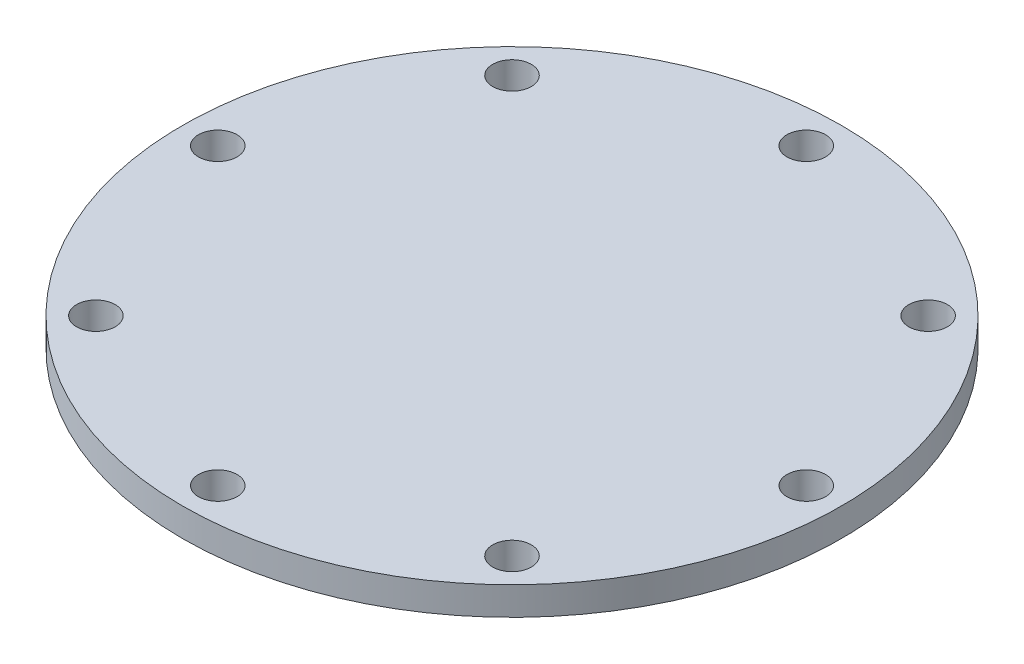
ISO-10303-21;
HEADER;
FILE_DESCRIPTION(('STEP AP214'),'2;1');
FILE_NAME('part.step','',(''),(''),'','','');
FILE_SCHEMA(('AUTOMOTIVE_DESIGN { 1 0 10303 214 1 1 1 1 }'));
ENDSEC;
DATA;
#1=APPLICATION_CONTEXT('core data for automotive mechanical design processes');
#2=APPLICATION_PROTOCOL_DEFINITION('international standard','automotive_design',2000,#1);
#3=PRODUCT_CONTEXT('',#1,'mechanical');
#4=PRODUCT('Part','Part','',(#3));
#5=PRODUCT_RELATED_PRODUCT_CATEGORY('part','',(#4));
#6=PRODUCT_DEFINITION_FORMATION('','',#4);
#7=PRODUCT_DEFINITION_CONTEXT('part definition',#1,'design');
#8=PRODUCT_DEFINITION('design','',#6,#7);
#9=PRODUCT_DEFINITION_SHAPE('','',#8);
#10=(LENGTH_UNIT() NAMED_UNIT(*) SI_UNIT(.MILLI.,.METRE.));
#11=(NAMED_UNIT(*) PLANE_ANGLE_UNIT() SI_UNIT($,.RADIAN.));
#12=(NAMED_UNIT(*) SI_UNIT($,.STERADIAN.) SOLID_ANGLE_UNIT());
#13=UNCERTAINTY_MEASURE_WITH_UNIT(LENGTH_MEASURE(1.E-05),#10,'distance_accuracy_value','');
#14=(GEOMETRIC_REPRESENTATION_CONTEXT(3) GLOBAL_UNCERTAINTY_ASSIGNED_CONTEXT((#13)) GLOBAL_UNIT_ASSIGNED_CONTEXT((#10,
#11,#12)) REPRESENTATION_CONTEXT('',''));
#15=CARTESIAN_POINT('',(0.,0.,0.));
#16=DIRECTION('',(0.,0.,1.));
#17=DIRECTION('',(1.,0.,0.));
#18=AXIS2_PLACEMENT_3D('',#15,#16,#17);
#19=CARTESIAN_POINT('',(0.,6.,0.));
#20=DIRECTION('',(0.,1.,0.));
#21=DIRECTION('',(0.,0.,1.));
#22=AXIS2_PLACEMENT_3D('',#19,#20,#21);
#23=PLANE('',#22);
#24=CARTESIAN_POINT('',(-62.4999999999955,6.,4.47612288020615E-12));
#25=DIRECTION('',(0.,1.,0.));
#26=DIRECTION('',(0.,0.,1.));
#27=AXIS2_PLACEMENT_3D('',#24,#25,#26);
#28=CIRCLE('',#27,4.1);
#29=CARTESIAN_POINT('',(-62.4999999999955,6.,4.10000000000448));
#30=VERTEX_POINT('',#29);
#31=EDGE_CURVE('E105',#30,#30,#28,.T.);
#32=ORIENTED_EDGE('',*,*,#31,.F.);
#33=EDGE_LOOP('',(#32));
#34=FACE_BOUND('',#33,.T.);
#35=CARTESIAN_POINT('',(8.93693767542296E-12,6.,62.5));
#36=DIRECTION('',(0.,1.,0.));
#37=DIRECTION('',(0.,0.,1.));
#38=AXIS2_PLACEMENT_3D('',#35,#36,#37);
#39=CIRCLE('',#38,4.1);
#40=CARTESIAN_POINT('',(8.93693767542296E-12,6.,66.6));
#41=VERTEX_POINT('',#40);
#42=EDGE_CURVE('E109',#41,#41,#39,.T.);
#43=ORIENTED_EDGE('',*,*,#42,.F.);
#44=EDGE_LOOP('',(#43));
#45=FACE_BOUND('',#44,.T.);
#46=CARTESIAN_POINT('',(62.5000000000045,6.,-4.46846883771148E-12));
#47=DIRECTION('',(0.,1.,0.));
#48=DIRECTION('',(0.,0.,1.));
#49=AXIS2_PLACEMENT_3D('',#46,#47,#48);
#50=CIRCLE('',#49,4.09999999999999);
#51=CARTESIAN_POINT('',(62.5000000000045,6.,4.09999999999552));
#52=VERTEX_POINT('',#51);
#53=EDGE_CURVE('E71',#52,#52,#50,.T.);
#54=ORIENTED_EDGE('',*,*,#53,.F.);
#55=EDGE_LOOP('',(#54));
#56=FACE_BOUND('',#55,.T.);
#57=CARTESIAN_POINT('',(0.,6.,-62.5));
#58=DIRECTION('',(0.,1.,0.));
#59=DIRECTION('',(0.,0.,1.));
#60=AXIS2_PLACEMENT_3D('',#57,#58,#59);
#61=CIRCLE('',#60,4.1);
#62=CARTESIAN_POINT('',(0.,6.,-58.4));
#63=VERTEX_POINT('',#62);
#64=EDGE_CURVE('E50',#63,#63,#61,.T.);
#65=ORIENTED_EDGE('',*,*,#64,.F.);
#66=EDGE_LOOP('',(#65));
#67=FACE_BOUND('',#66,.T.);
#68=CARTESIAN_POINT('',(0.,6.,0.));
#69=DIRECTION('',(0.,1.,0.));
#70=DIRECTION('',(0.,0.,1.));
#71=AXIS2_PLACEMENT_3D('',#68,#69,#70);
#72=CIRCLE('',#71,70.);
#73=CARTESIAN_POINT('',(0.,6.,70.));
#74=VERTEX_POINT('',#73);
#75=EDGE_CURVE('E11',#74,#74,#72,.T.);
#76=ORIENTED_EDGE('',*,*,#75,.T.);
#77=EDGE_LOOP('',(#76));
#78=FACE_BOUND('',#77,.T.);
#79=CARTESIAN_POINT('',(44.1941738241605,6.,-44.1941738241624));
#80=DIRECTION('',(0.,1.,0.));
#81=DIRECTION('',(0.,0.,1.));
#82=AXIS2_PLACEMENT_3D('',#79,#80,#81);
#83=CIRCLE('',#82,4.1);
#84=CARTESIAN_POINT('',(44.1941738241605,6.,-40.0941738241624));
#85=VERTEX_POINT('',#84);
#86=EDGE_CURVE('E62',#85,#85,#83,.T.);
#87=ORIENTED_EDGE('',*,*,#86,.F.);
#88=EDGE_LOOP('',(#87));
#89=FACE_BOUND('',#88,.T.);
#90=CARTESIAN_POINT('',(44.1941738241668,6.,44.1941738241561));
#91=DIRECTION('',(0.,1.,0.));
#92=DIRECTION('',(0.,0.,1.));
#93=AXIS2_PLACEMENT_3D('',#90,#91,#92);
#94=CIRCLE('',#93,4.1);
#95=CARTESIAN_POINT('',(44.1941738241668,6.,48.2941738241561));
#96=VERTEX_POINT('',#95);
#97=EDGE_CURVE('E119',#96,#96,#94,.T.);
#98=ORIENTED_EDGE('',*,*,#97,.F.);
#99=EDGE_LOOP('',(#98));
#100=FACE_BOUND('',#99,.T.);
#101=CARTESIAN_POINT('',(-44.1941738241516,6.,44.1941738241624));
#102=DIRECTION('',(0.,1.,0.));
#103=DIRECTION('',(0.,0.,1.));
#104=AXIS2_PLACEMENT_3D('',#101,#102,#103);
#105=CIRCLE('',#104,4.1);
#106=CARTESIAN_POINT('',(-44.1941738241516,6.,48.2941738241624));
#107=VERTEX_POINT('',#106);
#108=EDGE_CURVE('E123',#107,#107,#105,.T.);
#109=ORIENTED_EDGE('',*,*,#108,.F.);
#110=EDGE_LOOP('',(#109));
#111=FACE_BOUND('',#110,.T.);
#112=CARTESIAN_POINT('',(-44.1941738241579,6.,-44.1941738241561));
#113=DIRECTION('',(0.,1.,0.));
#114=DIRECTION('',(0.,0.,1.));
#115=AXIS2_PLACEMENT_3D('',#112,#113,#114);
#116=CIRCLE('',#115,4.1);
#117=CARTESIAN_POINT('',(-44.1941738241579,6.,-40.0941738241561));
#118=VERTEX_POINT('',#117);
#119=EDGE_CURVE('E126',#118,#118,#116,.T.);
#120=ORIENTED_EDGE('',*,*,#119,.F.);
#121=EDGE_LOOP('',(#120));
#122=FACE_BOUND('',#121,.T.);
#123=ADVANCED_FACE('F36',(#34,#45,#56,#67,#78,#89,#100,#111,#122),#23,.T.);
#124=CARTESIAN_POINT('',(0.,0.,0.));
#125=DIRECTION('',(0.,1.,0.));
#126=DIRECTION('',(0.,0.,1.));
#127=AXIS2_PLACEMENT_3D('',#124,#125,#126);
#128=PLANE('',#127);
#129=CARTESIAN_POINT('',(0.,0.,0.));
#130=DIRECTION('',(0.,1.,0.));
#131=DIRECTION('',(0.,0.,1.));
#132=AXIS2_PLACEMENT_3D('',#129,#130,#131);
#133=CIRCLE('',#132,70.);
#134=CARTESIAN_POINT('',(0.,0.,70.));
#135=VERTEX_POINT('',#134);
#136=EDGE_CURVE('E40',#135,#135,#133,.T.);
#137=ORIENTED_EDGE('',*,*,#136,.F.);
#138=EDGE_LOOP('',(#137));
#139=FACE_BOUND('',#138,.T.);
#140=CARTESIAN_POINT('',(0.,0.,-62.5));
#141=DIRECTION('',(0.,1.,0.));
#142=DIRECTION('',(0.,0.,1.));
#143=AXIS2_PLACEMENT_3D('',#140,#141,#142);
#144=CIRCLE('',#143,4.1);
#145=CARTESIAN_POINT('',(0.,0.,-58.4));
#146=VERTEX_POINT('',#145);
#147=EDGE_CURVE('E53',#146,#146,#144,.T.);
#148=ORIENTED_EDGE('',*,*,#147,.T.);
#149=EDGE_LOOP('',(#148));
#150=FACE_BOUND('',#149,.T.);
#151=CARTESIAN_POINT('',(44.1941738241605,0.,-44.1941738241624));
#152=DIRECTION('',(0.,1.,0.));
#153=DIRECTION('',(0.,0.,1.));
#154=AXIS2_PLACEMENT_3D('',#151,#152,#153);
#155=CIRCLE('',#154,4.1);
#156=CARTESIAN_POINT('',(44.1941738241605,0.,-40.0941738241624));
#157=VERTEX_POINT('',#156);
#158=EDGE_CURVE('E67',#157,#157,#155,.T.);
#159=ORIENTED_EDGE('',*,*,#158,.T.);
#160=EDGE_LOOP('',(#159));
#161=FACE_BOUND('',#160,.T.);
#162=CARTESIAN_POINT('',(62.5000000000045,0.,-4.46846883771148E-12));
#163=DIRECTION('',(0.,1.,0.));
#164=DIRECTION('',(0.,0.,1.));
#165=AXIS2_PLACEMENT_3D('',#162,#163,#164);
#166=CIRCLE('',#165,4.09999999999999);
#167=CARTESIAN_POINT('',(62.5000000000045,0.,4.09999999999552));
#168=VERTEX_POINT('',#167);
#169=EDGE_CURVE('E68',#168,#168,#166,.T.);
#170=ORIENTED_EDGE('',*,*,#169,.T.);
#171=EDGE_LOOP('',(#170));
#172=FACE_BOUND('',#171,.T.);
#173=CARTESIAN_POINT('',(44.1941738241668,0.,44.1941738241561));
#174=DIRECTION('',(0.,1.,0.));
#175=DIRECTION('',(0.,0.,1.));
#176=AXIS2_PLACEMENT_3D('',#173,#174,#175);
#177=CIRCLE('',#176,4.1);
#178=CARTESIAN_POINT('',(44.1941738241668,0.,48.2941738241561));
#179=VERTEX_POINT('',#178);
#180=EDGE_CURVE('E149',#179,#179,#177,.T.);
#181=ORIENTED_EDGE('',*,*,#180,.T.);
#182=EDGE_LOOP('',(#181));
#183=FACE_BOUND('',#182,.T.);
#184=CARTESIAN_POINT('',(8.93693767542296E-12,0.,62.5));
#185=DIRECTION('',(0.,1.,0.));
#186=DIRECTION('',(0.,0.,1.));
#187=AXIS2_PLACEMENT_3D('',#184,#185,#186);
#188=CIRCLE('',#187,4.1);
#189=CARTESIAN_POINT('',(8.93693767542296E-12,0.,66.6));
#190=VERTEX_POINT('',#189);
#191=EDGE_CURVE('E150',#190,#190,#188,.T.);
#192=ORIENTED_EDGE('',*,*,#191,.T.);
#193=EDGE_LOOP('',(#192));
#194=FACE_BOUND('',#193,.T.);
#195=CARTESIAN_POINT('',(-44.1941738241516,0.,44.1941738241624));
#196=DIRECTION('',(0.,1.,0.));
#197=DIRECTION('',(0.,0.,1.));
#198=AXIS2_PLACEMENT_3D('',#195,#196,#197);
#199=CIRCLE('',#198,4.1);
#200=CARTESIAN_POINT('',(-44.1941738241516,0.,48.2941738241624));
#201=VERTEX_POINT('',#200);
#202=EDGE_CURVE('E140',#201,#201,#199,.T.);
#203=ORIENTED_EDGE('',*,*,#202,.T.);
#204=EDGE_LOOP('',(#203));
#205=FACE_BOUND('',#204,.T.);
#206=CARTESIAN_POINT('',(-62.4999999999955,0.,4.47612288020615E-12));
#207=DIRECTION('',(0.,1.,0.));
#208=DIRECTION('',(0.,0.,1.));
#209=AXIS2_PLACEMENT_3D('',#206,#207,#208);
#210=CIRCLE('',#209,4.1);
#211=CARTESIAN_POINT('',(-62.4999999999955,0.,4.10000000000448));
#212=VERTEX_POINT('',#211);
#213=EDGE_CURVE('E129',#212,#212,#210,.T.);
#214=ORIENTED_EDGE('',*,*,#213,.T.);
#215=EDGE_LOOP('',(#214));
#216=FACE_BOUND('',#215,.T.);
#217=CARTESIAN_POINT('',(-44.1941738241579,0.,-44.1941738241561));
#218=DIRECTION('',(0.,1.,0.));
#219=DIRECTION('',(0.,0.,1.));
#220=AXIS2_PLACEMENT_3D('',#217,#218,#219);
#221=CIRCLE('',#220,4.1);
#222=CARTESIAN_POINT('',(-44.1941738241579,0.,-40.0941738241561));
#223=VERTEX_POINT('',#222);
#224=EDGE_CURVE('E130',#223,#223,#221,.T.);
#225=ORIENTED_EDGE('',*,*,#224,.T.);
#226=EDGE_LOOP('',(#225));
#227=FACE_BOUND('',#226,.T.);
#228=ADVANCED_FACE('F80',(#139,#150,#161,#172,#183,#194,#205,#216,#227),#128,.F.);
#229=CARTESIAN_POINT('',(0.,6.,0.));
#230=DIRECTION('',(0.,-1.,0.));
#231=DIRECTION('',(0.,0.,-1.));
#232=AXIS2_PLACEMENT_3D('',#229,#230,#231);
#233=CYLINDRICAL_SURFACE('',#232,70.);
#234=ORIENTED_EDGE('',*,*,#75,.F.);
#235=EDGE_LOOP('',(#234));
#236=FACE_BOUND('',#235,.T.);
#237=ORIENTED_EDGE('',*,*,#136,.T.);
#238=EDGE_LOOP('',(#237));
#239=FACE_BOUND('',#238,.T.);
#240=ADVANCED_FACE('F38',(#236,#239),#233,.T.);
#241=CARTESIAN_POINT('',(0.,6.,-62.5));
#242=DIRECTION('',(0.,-1.,0.));
#243=DIRECTION('',(0.,0.,-1.));
#244=AXIS2_PLACEMENT_3D('',#241,#242,#243);
#245=CYLINDRICAL_SURFACE('',#244,4.1);
#246=ORIENTED_EDGE('',*,*,#64,.T.);
#247=EDGE_LOOP('',(#246));
#248=FACE_BOUND('',#247,.T.);
#249=ORIENTED_EDGE('',*,*,#147,.F.);
#250=EDGE_LOOP('',(#249));
#251=FACE_BOUND('',#250,.T.);
#252=ADVANCED_FACE('F83',(#248,#251),#245,.F.);
#253=CARTESIAN_POINT('',(44.1941738241605,6.,-44.1941738241624));
#254=DIRECTION('',(0.,-1.,0.));
#255=DIRECTION('',(0.,0.,-1.));
#256=AXIS2_PLACEMENT_3D('',#253,#254,#255);
#257=CYLINDRICAL_SURFACE('',#256,4.1);
#258=ORIENTED_EDGE('',*,*,#86,.T.);
#259=EDGE_LOOP('',(#258));
#260=FACE_BOUND('',#259,.T.);
#261=ORIENTED_EDGE('',*,*,#158,.F.);
#262=EDGE_LOOP('',(#261));
#263=FACE_BOUND('',#262,.T.);
#264=ADVANCED_FACE('F85',(#260,#263),#257,.F.);
#265=CARTESIAN_POINT('',(62.5000000000045,6.,-4.46846883771148E-12));
#266=DIRECTION('',(0.,-1.,0.));
#267=DIRECTION('',(0.,0.,-1.));
#268=AXIS2_PLACEMENT_3D('',#265,#266,#267);
#269=CYLINDRICAL_SURFACE('',#268,4.09999999999999);
#270=ORIENTED_EDGE('',*,*,#53,.T.);
#271=EDGE_LOOP('',(#270));
#272=FACE_BOUND('',#271,.T.);
#273=ORIENTED_EDGE('',*,*,#169,.F.);
#274=EDGE_LOOP('',(#273));
#275=FACE_BOUND('',#274,.T.);
#276=ADVANCED_FACE('F91',(#272,#275),#269,.F.);
#277=CARTESIAN_POINT('',(44.1941738241668,6.,44.1941738241561));
#278=DIRECTION('',(0.,-1.,0.));
#279=DIRECTION('',(0.,0.,-1.));
#280=AXIS2_PLACEMENT_3D('',#277,#278,#279);
#281=CYLINDRICAL_SURFACE('',#280,4.1);
#282=ORIENTED_EDGE('',*,*,#97,.T.);
#283=EDGE_LOOP('',(#282));
#284=FACE_BOUND('',#283,.T.);
#285=ORIENTED_EDGE('',*,*,#180,.F.);
#286=EDGE_LOOP('',(#285));
#287=FACE_BOUND('',#286,.T.);
#288=ADVANCED_FACE('F164',(#284,#287),#281,.F.);
#289=CARTESIAN_POINT('',(8.93693767542296E-12,6.,62.5));
#290=DIRECTION('',(0.,-1.,0.));
#291=DIRECTION('',(0.,0.,-1.));
#292=AXIS2_PLACEMENT_3D('',#289,#290,#291);
#293=CYLINDRICAL_SURFACE('',#292,4.1);
#294=ORIENTED_EDGE('',*,*,#42,.T.);
#295=EDGE_LOOP('',(#294));
#296=FACE_BOUND('',#295,.T.);
#297=ORIENTED_EDGE('',*,*,#191,.F.);
#298=EDGE_LOOP('',(#297));
#299=FACE_BOUND('',#298,.T.);
#300=ADVANCED_FACE('F169',(#296,#299),#293,.F.);
#301=CARTESIAN_POINT('',(-44.1941738241516,6.,44.1941738241624));
#302=DIRECTION('',(0.,-1.,0.));
#303=DIRECTION('',(0.,0.,-1.));
#304=AXIS2_PLACEMENT_3D('',#301,#302,#303);
#305=CYLINDRICAL_SURFACE('',#304,4.1);
#306=ORIENTED_EDGE('',*,*,#108,.T.);
#307=EDGE_LOOP('',(#306));
#308=FACE_BOUND('',#307,.T.);
#309=ORIENTED_EDGE('',*,*,#202,.F.);
#310=EDGE_LOOP('',(#309));
#311=FACE_BOUND('',#310,.T.);
#312=ADVANCED_FACE('F175',(#308,#311),#305,.F.);
#313=CARTESIAN_POINT('',(-62.4999999999955,6.,4.47612288020615E-12));
#314=DIRECTION('',(0.,-1.,0.));
#315=DIRECTION('',(0.,0.,-1.));
#316=AXIS2_PLACEMENT_3D('',#313,#314,#315);
#317=CYLINDRICAL_SURFACE('',#316,4.1);
#318=ORIENTED_EDGE('',*,*,#31,.T.);
#319=EDGE_LOOP('',(#318));
#320=FACE_BOUND('',#319,.T.);
#321=ORIENTED_EDGE('',*,*,#213,.F.);
#322=EDGE_LOOP('',(#321));
#323=FACE_BOUND('',#322,.T.);
#324=ADVANCED_FACE('F179',(#320,#323),#317,.F.);
#325=CARTESIAN_POINT('',(-44.1941738241579,6.,-44.1941738241561));
#326=DIRECTION('',(0.,-1.,0.));
#327=DIRECTION('',(0.,0.,-1.));
#328=AXIS2_PLACEMENT_3D('',#325,#326,#327);
#329=CYLINDRICAL_SURFACE('',#328,4.1);
#330=ORIENTED_EDGE('',*,*,#119,.T.);
#331=EDGE_LOOP('',(#330));
#332=FACE_BOUND('',#331,.T.);
#333=ORIENTED_EDGE('',*,*,#224,.F.);
#334=EDGE_LOOP('',(#333));
#335=FACE_BOUND('',#334,.T.);
#336=ADVANCED_FACE('F183',(#332,#335),#329,.F.);
#337=CLOSED_SHELL('',(#123,#228,#240,#252,#264,#276,#288,#300,#312,#324,#336));
#338=MANIFOLD_SOLID_BREP('B2',#337);
#339=ADVANCED_BREP_SHAPE_REPRESENTATION('',(#18,#338),#14);
#340=SHAPE_DEFINITION_REPRESENTATION(#9,#339);
ENDSEC;
END-ISO-10303-21;
